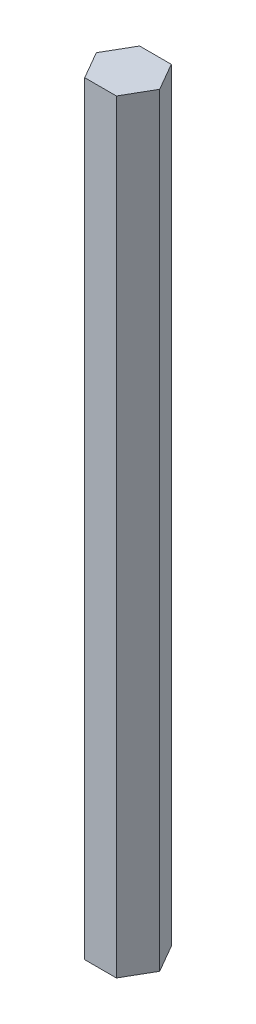
ISO-10303-21;
HEADER;
FILE_DESCRIPTION(('STEP AP214'),'2;1');
FILE_NAME('part.step','',(''),(''),'','','');
FILE_SCHEMA(('AUTOMOTIVE_DESIGN { 1 0 10303 214 1 1 1 1 }'));
ENDSEC;
DATA;
#1=APPLICATION_CONTEXT('core data for automotive mechanical design processes');
#2=APPLICATION_PROTOCOL_DEFINITION('international standard','automotive_design',2000,#1);
#3=PRODUCT_CONTEXT('',#1,'mechanical');
#4=PRODUCT('Part','Part','',(#3));
#5=PRODUCT_RELATED_PRODUCT_CATEGORY('part','',(#4));
#6=PRODUCT_DEFINITION_FORMATION('','',#4);
#7=PRODUCT_DEFINITION_CONTEXT('part definition',#1,'design');
#8=PRODUCT_DEFINITION('design','',#6,#7);
#9=PRODUCT_DEFINITION_SHAPE('','',#8);
#10=(LENGTH_UNIT() NAMED_UNIT(*) SI_UNIT(.MILLI.,.METRE.));
#11=(NAMED_UNIT(*) PLANE_ANGLE_UNIT() SI_UNIT($,.RADIAN.));
#12=(NAMED_UNIT(*) SI_UNIT($,.STERADIAN.) SOLID_ANGLE_UNIT());
#13=UNCERTAINTY_MEASURE_WITH_UNIT(LENGTH_MEASURE(1.E-05),#10,'distance_accuracy_value','');
#14=(GEOMETRIC_REPRESENTATION_CONTEXT(3) GLOBAL_UNCERTAINTY_ASSIGNED_CONTEXT((#13)) GLOBAL_UNIT_ASSIGNED_CONTEXT((#10,
#11,#12)) REPRESENTATION_CONTEXT('',''));
#15=CARTESIAN_POINT('',(0.,0.,0.));
#16=DIRECTION('',(0.,0.,1.));
#17=DIRECTION('',(1.,0.,0.));
#18=AXIS2_PLACEMENT_3D('',#15,#16,#17);
#19=CARTESIAN_POINT('',(3.97705905170191,192.89,5.34885921686965));
#20=DIRECTION('',(-0.866025403784439,0.,-0.5));
#21=DIRECTION('',(-0.5,0.,0.866025403784439));
#22=AXIS2_PLACEMENT_3D('',#19,#20,#21);
#23=PLANE('',#22);
#24=DIRECTION('',(0.5,0.,-0.866025403784439));
#25=VECTOR('',#24,1.);
#26=CARTESIAN_POINT('',(3.97705905170191,0.,5.34885921686965));
#27=LINE('',#26,#25);
#28=CARTESIAN_POINT('',(3.97705905170191,0.,5.34885921686965));
#29=VERTEX_POINT('',#28);
#30=CARTESIAN_POINT('',(7.97705905170191,0.,-1.57934401340586));
#31=VERTEX_POINT('',#30);
#32=EDGE_CURVE('E132',#29,#31,#27,.T.);
#33=ORIENTED_EDGE('',*,*,#32,.T.);
#34=DIRECTION('',(0.,-1.,0.));
#35=VECTOR('',#34,1.);
#36=CARTESIAN_POINT('',(7.97705905170191,192.89,-1.57934401340586));
#37=LINE('',#36,#35);
#38=CARTESIAN_POINT('',(7.97705905170191,192.89,-1.57934401340586));
#39=VERTEX_POINT('',#38);
#40=EDGE_CURVE('E11',#39,#31,#37,.T.);
#41=ORIENTED_EDGE('',*,*,#40,.F.);
#42=DIRECTION('',(0.5,0.,-0.866025403784439));
#43=VECTOR('',#42,1.);
#44=CARTESIAN_POINT('',(3.97705905170191,192.89,5.34885921686965));
#45=LINE('',#44,#43);
#46=CARTESIAN_POINT('',(3.97705905170191,192.89,5.34885921686965));
#47=VERTEX_POINT('',#46);
#48=EDGE_CURVE('E148',#47,#39,#45,.T.);
#49=ORIENTED_EDGE('',*,*,#48,.F.);
#50=DIRECTION('',(0.,-1.,0.));
#51=VECTOR('',#50,1.);
#52=CARTESIAN_POINT('',(3.97705905170191,192.89,5.34885921686965));
#53=LINE('',#52,#51);
#54=EDGE_CURVE('E128',#47,#29,#53,.T.);
#55=ORIENTED_EDGE('',*,*,#54,.T.);
#56=EDGE_LOOP('',(#33,#41,#49,#55));
#57=FACE_BOUND('',#56,.T.);
#58=ADVANCED_FACE('F43',(#57),#23,.F.);
#59=CARTESIAN_POINT('',(7.97705905170191,192.89,-1.57934401340586));
#60=DIRECTION('',(-0.866025403784438,0.,0.5));
#61=DIRECTION('',(0.5,0.,0.866025403784439));
#62=AXIS2_PLACEMENT_3D('',#59,#60,#61);
#63=PLANE('',#62);
#64=DIRECTION('',(-0.5,0.,-0.866025403784439));
#65=VECTOR('',#64,1.);
#66=CARTESIAN_POINT('',(7.97705905170191,0.,-1.57934401340586));
#67=LINE('',#66,#65);
#68=CARTESIAN_POINT('',(3.97705905170191,0.,-8.50754724368137));
#69=VERTEX_POINT('',#68);
#70=EDGE_CURVE('E136',#31,#69,#67,.T.);
#71=ORIENTED_EDGE('',*,*,#70,.T.);
#72=DIRECTION('',(0.,-1.,0.));
#73=VECTOR('',#72,1.);
#74=CARTESIAN_POINT('',(3.97705905170191,192.89,-8.50754724368137));
#75=LINE('',#74,#73);
#76=CARTESIAN_POINT('',(3.97705905170191,192.89,-8.50754724368137));
#77=VERTEX_POINT('',#76);
#78=EDGE_CURVE('E52',#77,#69,#75,.T.);
#79=ORIENTED_EDGE('',*,*,#78,.F.);
#80=DIRECTION('',(-0.5,0.,-0.866025403784439));
#81=VECTOR('',#80,1.);
#82=CARTESIAN_POINT('',(7.97705905170191,192.89,-1.57934401340586));
#83=LINE('',#82,#81);
#84=EDGE_CURVE('E97',#39,#77,#83,.T.);
#85=ORIENTED_EDGE('',*,*,#84,.F.);
#86=ORIENTED_EDGE('',*,*,#40,.T.);
#87=EDGE_LOOP('',(#71,#79,#85,#86));
#88=FACE_BOUND('',#87,.T.);
#89=ADVANCED_FACE('F176',(#88),#63,.F.);
#90=CARTESIAN_POINT('',(3.97705905170191,192.89,-8.50754724368137));
#91=DIRECTION('',(0.,0.,1.));
#92=DIRECTION('',(1.,0.,0.));
#93=AXIS2_PLACEMENT_3D('',#90,#91,#92);
#94=PLANE('',#93);
#95=DIRECTION('',(-1.,0.,0.));
#96=VECTOR('',#95,1.);
#97=CARTESIAN_POINT('',(3.97705905170191,0.,-8.50754724368137));
#98=LINE('',#97,#96);
#99=CARTESIAN_POINT('',(-4.02294094829809,0.,-8.50754724368137));
#100=VERTEX_POINT('',#99);
#101=EDGE_CURVE('E139',#69,#100,#98,.T.);
#102=ORIENTED_EDGE('',*,*,#101,.T.);
#103=DIRECTION('',(0.,-1.,0.));
#104=VECTOR('',#103,1.);
#105=CARTESIAN_POINT('',(-4.02294094829809,192.89,-8.50754724368137));
#106=LINE('',#105,#104);
#107=CARTESIAN_POINT('',(-4.02294094829809,192.89,-8.50754724368137));
#108=VERTEX_POINT('',#107);
#109=EDGE_CURVE('E121',#108,#100,#106,.T.);
#110=ORIENTED_EDGE('',*,*,#109,.F.);
#111=DIRECTION('',(-1.,0.,0.));
#112=VECTOR('',#111,1.);
#113=CARTESIAN_POINT('',(3.97705905170191,192.89,-8.50754724368137));
#114=LINE('',#113,#112);
#115=EDGE_CURVE('E110',#77,#108,#114,.T.);
#116=ORIENTED_EDGE('',*,*,#115,.F.);
#117=ORIENTED_EDGE('',*,*,#78,.T.);
#118=EDGE_LOOP('',(#102,#110,#116,#117));
#119=FACE_BOUND('',#118,.T.);
#120=ADVANCED_FACE('F158',(#119),#94,.F.);
#121=CARTESIAN_POINT('',(-4.02294094829809,192.89,-8.50754724368137));
#122=DIRECTION('',(0.866025403784438,0.,0.5));
#123=DIRECTION('',(0.5,0.,-0.866025403784439));
#124=AXIS2_PLACEMENT_3D('',#121,#122,#123);
#125=PLANE('',#124);
#126=DIRECTION('',(-0.5,0.,0.866025403784439));
#127=VECTOR('',#126,1.);
#128=CARTESIAN_POINT('',(-4.02294094829809,0.,-8.50754724368137));
#129=LINE('',#128,#127);
#130=CARTESIAN_POINT('',(-8.02294094829809,0.,-1.57934401340586));
#131=VERTEX_POINT('',#130);
#132=EDGE_CURVE('E119',#100,#131,#129,.T.);
#133=ORIENTED_EDGE('',*,*,#132,.T.);
#134=DIRECTION('',(0.,-1.,0.));
#135=VECTOR('',#134,1.);
#136=CARTESIAN_POINT('',(-8.02294094829809,192.89,-1.57934401340586));
#137=LINE('',#136,#135);
#138=CARTESIAN_POINT('',(-8.02294094829809,192.89,-1.57934401340586));
#139=VERTEX_POINT('',#138);
#140=EDGE_CURVE('E116',#139,#131,#137,.T.);
#141=ORIENTED_EDGE('',*,*,#140,.F.);
#142=DIRECTION('',(-0.5,0.,0.866025403784439));
#143=VECTOR('',#142,1.);
#144=CARTESIAN_POINT('',(-4.02294094829809,192.89,-8.50754724368137));
#145=LINE('',#144,#143);
#146=EDGE_CURVE('E104',#108,#139,#145,.T.);
#147=ORIENTED_EDGE('',*,*,#146,.F.);
#148=ORIENTED_EDGE('',*,*,#109,.T.);
#149=EDGE_LOOP('',(#133,#141,#147,#148));
#150=FACE_BOUND('',#149,.T.);
#151=ADVANCED_FACE('F117',(#150),#125,.F.);
#152=CARTESIAN_POINT('',(-8.02294094829809,192.89,-1.57934401340586));
#153=DIRECTION('',(0.866025403784438,0.,-0.500000000000001));
#154=DIRECTION('',(-0.500000000000001,0.,-0.866025403784438));
#155=AXIS2_PLACEMENT_3D('',#152,#153,#154);
#156=PLANE('',#155);
#157=DIRECTION('',(0.500000000000001,0.,0.866025403784438));
#158=VECTOR('',#157,1.);
#159=CARTESIAN_POINT('',(-8.02294094829809,0.,-1.57934401340586));
#160=LINE('',#159,#158);
#161=CARTESIAN_POINT('',(-4.02294094829809,0.,5.34885921686965));
#162=VERTEX_POINT('',#161);
#163=EDGE_CURVE('E83',#131,#162,#160,.T.);
#164=ORIENTED_EDGE('',*,*,#163,.T.);
#165=DIRECTION('',(0.,-1.,0.));
#166=VECTOR('',#165,1.);
#167=CARTESIAN_POINT('',(-4.02294094829809,192.89,5.34885921686965));
#168=LINE('',#167,#166);
#169=CARTESIAN_POINT('',(-4.02294094829809,192.89,5.34885921686965));
#170=VERTEX_POINT('',#169);
#171=EDGE_CURVE('E122',#170,#162,#168,.T.);
#172=ORIENTED_EDGE('',*,*,#171,.F.);
#173=DIRECTION('',(0.500000000000001,0.,0.866025403784438));
#174=VECTOR('',#173,1.);
#175=CARTESIAN_POINT('',(-8.02294094829809,192.89,-1.57934401340586));
#176=LINE('',#175,#174);
#177=EDGE_CURVE('E108',#139,#170,#176,.T.);
#178=ORIENTED_EDGE('',*,*,#177,.F.);
#179=ORIENTED_EDGE('',*,*,#140,.T.);
#180=EDGE_LOOP('',(#164,#172,#178,#179));
#181=FACE_BOUND('',#180,.T.);
#182=ADVANCED_FACE('F124',(#181),#156,.F.);
#183=CARTESIAN_POINT('',(-4.02294094829809,192.89,5.34885921686965));
#184=DIRECTION('',(0.,0.,-1.));
#185=DIRECTION('',(-1.,0.,0.));
#186=AXIS2_PLACEMENT_3D('',#183,#184,#185);
#187=PLANE('',#186);
#188=DIRECTION('',(1.,0.,0.));
#189=VECTOR('',#188,1.);
#190=CARTESIAN_POINT('',(-4.02294094829809,0.,5.34885921686965));
#191=LINE('',#190,#189);
#192=EDGE_CURVE('E89',#162,#29,#191,.T.);
#193=ORIENTED_EDGE('',*,*,#192,.T.);
#194=ORIENTED_EDGE('',*,*,#54,.F.);
#195=DIRECTION('',(1.,0.,0.));
#196=VECTOR('',#195,1.);
#197=CARTESIAN_POINT('',(-4.02294094829809,192.89,5.34885921686965));
#198=LINE('',#197,#196);
#199=EDGE_CURVE('E60',#170,#47,#198,.T.);
#200=ORIENTED_EDGE('',*,*,#199,.F.);
#201=ORIENTED_EDGE('',*,*,#171,.T.);
#202=EDGE_LOOP('',(#193,#194,#200,#201));
#203=FACE_BOUND('',#202,.T.);
#204=ADVANCED_FACE('F165',(#203),#187,.F.);
#205=CARTESIAN_POINT('',(0.,192.89,0.));
#206=DIRECTION('',(0.,1.,0.));
#207=DIRECTION('',(0.,0.,1.));
#208=AXIS2_PLACEMENT_3D('',#205,#206,#207);
#209=PLANE('',#208);
#210=ORIENTED_EDGE('',*,*,#48,.T.);
#211=ORIENTED_EDGE('',*,*,#84,.T.);
#212=ORIENTED_EDGE('',*,*,#115,.T.);
#213=ORIENTED_EDGE('',*,*,#146,.T.);
#214=ORIENTED_EDGE('',*,*,#177,.T.);
#215=ORIENTED_EDGE('',*,*,#199,.T.);
#216=EDGE_LOOP('',(#210,#211,#212,#213,#214,#215));
#217=FACE_BOUND('',#216,.T.);
#218=ADVANCED_FACE('F106',(#217),#209,.T.);
#219=CARTESIAN_POINT('',(0.,0.,0.));
#220=DIRECTION('',(0.,1.,0.));
#221=DIRECTION('',(0.,0.,1.));
#222=AXIS2_PLACEMENT_3D('',#219,#220,#221);
#223=PLANE('',#222);
#224=ORIENTED_EDGE('',*,*,#32,.F.);
#225=ORIENTED_EDGE('',*,*,#192,.F.);
#226=ORIENTED_EDGE('',*,*,#163,.F.);
#227=ORIENTED_EDGE('',*,*,#132,.F.);
#228=ORIENTED_EDGE('',*,*,#101,.F.);
#229=ORIENTED_EDGE('',*,*,#70,.F.);
#230=EDGE_LOOP('',(#224,#225,#226,#227,#228,#229));
#231=FACE_BOUND('',#230,.T.);
#232=ADVANCED_FACE('F161',(#231),#223,.F.);
#233=CLOSED_SHELL('',(#58,#89,#120,#151,#182,#204,#218,#232));
#234=MANIFOLD_SOLID_BREP('B2',#233);
#235=ADVANCED_BREP_SHAPE_REPRESENTATION('',(#18,#234),#14);
#236=SHAPE_DEFINITION_REPRESENTATION(#9,#235);
ENDSEC;
END-ISO-10303-21;
